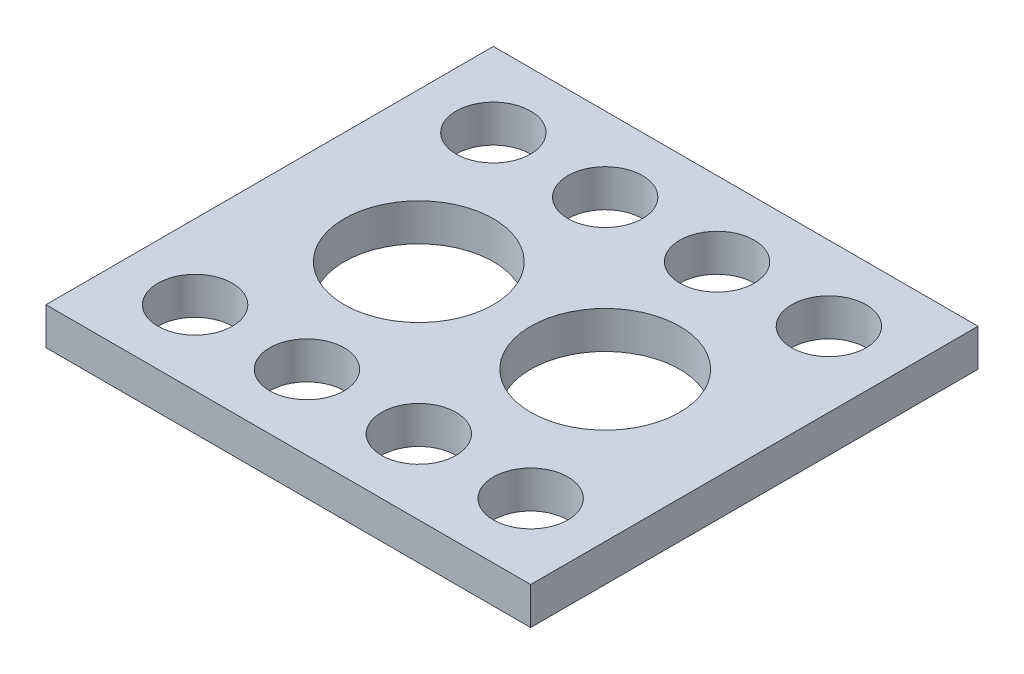
ISO-10303-21;
HEADER;
FILE_DESCRIPTION(('STEP AP214'),'2;1');
FILE_NAME('part.step','',(''),(''),'','','');
FILE_SCHEMA(('AUTOMOTIVE_DESIGN { 1 0 10303 214 1 1 1 1 }'));
ENDSEC;
DATA;
#1=APPLICATION_CONTEXT('core data for automotive mechanical design processes');
#2=APPLICATION_PROTOCOL_DEFINITION('international standard','automotive_design',2000,#1);
#3=PRODUCT_CONTEXT('',#1,'mechanical');
#4=PRODUCT('Part','Part','',(#3));
#5=PRODUCT_RELATED_PRODUCT_CATEGORY('part','',(#4));
#6=PRODUCT_DEFINITION_FORMATION('','',#4);
#7=PRODUCT_DEFINITION_CONTEXT('part definition',#1,'design');
#8=PRODUCT_DEFINITION('design','',#6,#7);
#9=PRODUCT_DEFINITION_SHAPE('','',#8);
#10=(LENGTH_UNIT() NAMED_UNIT(*) SI_UNIT(.MILLI.,.METRE.));
#11=(NAMED_UNIT(*) PLANE_ANGLE_UNIT() SI_UNIT($,.RADIAN.));
#12=(NAMED_UNIT(*) SI_UNIT($,.STERADIAN.) SOLID_ANGLE_UNIT());
#13=UNCERTAINTY_MEASURE_WITH_UNIT(LENGTH_MEASURE(1.E-05),#10,'distance_accuracy_value','');
#14=(GEOMETRIC_REPRESENTATION_CONTEXT(3) GLOBAL_UNCERTAINTY_ASSIGNED_CONTEXT((#13)) GLOBAL_UNIT_ASSIGNED_CONTEXT((#10,
#11,#12)) REPRESENTATION_CONTEXT('',''));
#15=CARTESIAN_POINT('',(0.,0.,0.));
#16=DIRECTION('',(0.,0.,1.));
#17=DIRECTION('',(1.,0.,0.));
#18=AXIS2_PLACEMENT_3D('',#15,#16,#17);
#19=CARTESIAN_POINT('',(0.,12.7,0.));
#20=DIRECTION('',(0.,-1.,0.));
#21=DIRECTION('',(0.,0.,-1.));
#22=AXIS2_PLACEMENT_3D('',#19,#20,#21);
#23=PLANE('',#22);
#24=DIRECTION('',(0.,0.,1.));
#25=VECTOR('',#24,1.);
#26=CARTESIAN_POINT('',(0.,12.7,0.));
#27=LINE('',#26,#25);
#28=CARTESIAN_POINT('',(0.,12.7,-152.4));
#29=VERTEX_POINT('',#28);
#30=CARTESIAN_POINT('',(0.,12.7,0.));
#31=VERTEX_POINT('',#30);
#32=EDGE_CURVE('E85',#29,#31,#27,.T.);
#33=ORIENTED_EDGE('',*,*,#32,.T.);
#34=DIRECTION('',(1.,0.,0.));
#35=VECTOR('',#34,1.);
#36=CARTESIAN_POINT('',(0.,12.7,0.));
#37=LINE('',#36,#35);
#38=CARTESIAN_POINT('',(165.1,12.7,0.));
#39=VERTEX_POINT('',#38);
#40=EDGE_CURVE('E80',#31,#39,#37,.T.);
#41=ORIENTED_EDGE('',*,*,#40,.T.);
#42=DIRECTION('',(0.,0.,-1.));
#43=VECTOR('',#42,1.);
#44=CARTESIAN_POINT('',(165.1,12.7,0.));
#45=LINE('',#44,#43);
#46=CARTESIAN_POINT('',(165.1,12.7,-152.4));
#47=VERTEX_POINT('',#46);
#48=EDGE_CURVE('E83',#39,#47,#45,.T.);
#49=ORIENTED_EDGE('',*,*,#48,.T.);
#50=DIRECTION('',(-1.,0.,0.));
#51=VECTOR('',#50,1.);
#52=CARTESIAN_POINT('',(0.,12.7,-152.4));
#53=LINE('',#52,#51);
#54=EDGE_CURVE('E50',#47,#29,#53,.T.);
#55=ORIENTED_EDGE('',*,*,#54,.T.);
#56=EDGE_LOOP('',(#33,#41,#49,#55));
#57=FACE_BOUND('',#56,.T.);
#58=CARTESIAN_POINT('',(25.4,12.7,-127.));
#59=DIRECTION('',(0.,1.,0.));
#60=DIRECTION('',(0.,0.,1.));
#61=AXIS2_PLACEMENT_3D('',#58,#59,#60);
#62=CIRCLE('',#61,12.7);
#63=CARTESIAN_POINT('',(25.4,12.7,-114.3));
#64=VERTEX_POINT('',#63);
#65=EDGE_CURVE('E100',#64,#64,#62,.T.);
#66=ORIENTED_EDGE('',*,*,#65,.F.);
#67=EDGE_LOOP('',(#66));
#68=FACE_BOUND('',#67,.T.);
#69=CARTESIAN_POINT('',(25.4,12.7,-25.4));
#70=DIRECTION('',(0.,1.,0.));
#71=DIRECTION('',(0.,0.,1.));
#72=AXIS2_PLACEMENT_3D('',#69,#70,#71);
#73=CIRCLE('',#72,12.7);
#74=CARTESIAN_POINT('',(25.4,12.7,-12.7));
#75=VERTEX_POINT('',#74);
#76=EDGE_CURVE('E115',#75,#75,#73,.T.);
#77=ORIENTED_EDGE('',*,*,#76,.F.);
#78=EDGE_LOOP('',(#77));
#79=FACE_BOUND('',#78,.T.);
#80=CARTESIAN_POINT('',(63.5,12.7,-127.));
#81=DIRECTION('',(0.,1.,0.));
#82=DIRECTION('',(0.,0.,1.));
#83=AXIS2_PLACEMENT_3D('',#80,#81,#82);
#84=CIRCLE('',#83,12.7);
#85=CARTESIAN_POINT('',(63.5,12.7,-114.3));
#86=VERTEX_POINT('',#85);
#87=EDGE_CURVE('E121',#86,#86,#84,.T.);
#88=ORIENTED_EDGE('',*,*,#87,.F.);
#89=EDGE_LOOP('',(#88));
#90=FACE_BOUND('',#89,.T.);
#91=CARTESIAN_POINT('',(101.6,12.7,-127.));
#92=DIRECTION('',(0.,1.,0.));
#93=DIRECTION('',(0.,0.,1.));
#94=AXIS2_PLACEMENT_3D('',#91,#92,#93);
#95=CIRCLE('',#94,12.7);
#96=CARTESIAN_POINT('',(101.6,12.7,-114.3));
#97=VERTEX_POINT('',#96);
#98=EDGE_CURVE('E127',#97,#97,#95,.T.);
#99=ORIENTED_EDGE('',*,*,#98,.F.);
#100=EDGE_LOOP('',(#99));
#101=FACE_BOUND('',#100,.T.);
#102=CARTESIAN_POINT('',(139.7,12.7,-127.));
#103=DIRECTION('',(0.,1.,0.));
#104=DIRECTION('',(0.,0.,1.));
#105=AXIS2_PLACEMENT_3D('',#102,#103,#104);
#106=CIRCLE('',#105,12.7);
#107=CARTESIAN_POINT('',(139.7,12.7,-114.3));
#108=VERTEX_POINT('',#107);
#109=EDGE_CURVE('E133',#108,#108,#106,.T.);
#110=ORIENTED_EDGE('',*,*,#109,.F.);
#111=EDGE_LOOP('',(#110));
#112=FACE_BOUND('',#111,.T.);
#113=CARTESIAN_POINT('',(63.5,12.7,-25.4));
#114=DIRECTION('',(0.,1.,0.));
#115=DIRECTION('',(0.,0.,1.));
#116=AXIS2_PLACEMENT_3D('',#113,#114,#115);
#117=CIRCLE('',#116,12.7);
#118=CARTESIAN_POINT('',(63.5,12.7,-12.7));
#119=VERTEX_POINT('',#118);
#120=EDGE_CURVE('E139',#119,#119,#117,.T.);
#121=ORIENTED_EDGE('',*,*,#120,.F.);
#122=EDGE_LOOP('',(#121));
#123=FACE_BOUND('',#122,.T.);
#124=CARTESIAN_POINT('',(101.6,12.7,-25.4));
#125=DIRECTION('',(0.,1.,0.));
#126=DIRECTION('',(0.,0.,1.));
#127=AXIS2_PLACEMENT_3D('',#124,#125,#126);
#128=CIRCLE('',#127,12.7);
#129=CARTESIAN_POINT('',(101.6,12.7,-12.7));
#130=VERTEX_POINT('',#129);
#131=EDGE_CURVE('E145',#130,#130,#128,.T.);
#132=ORIENTED_EDGE('',*,*,#131,.F.);
#133=EDGE_LOOP('',(#132));
#134=FACE_BOUND('',#133,.T.);
#135=CARTESIAN_POINT('',(139.7,12.7,-25.4));
#136=DIRECTION('',(0.,1.,0.));
#137=DIRECTION('',(0.,0.,1.));
#138=AXIS2_PLACEMENT_3D('',#135,#136,#137);
#139=CIRCLE('',#138,12.7);
#140=CARTESIAN_POINT('',(139.7,12.7,-12.7));
#141=VERTEX_POINT('',#140);
#142=EDGE_CURVE('E151',#141,#141,#139,.T.);
#143=ORIENTED_EDGE('',*,*,#142,.F.);
#144=EDGE_LOOP('',(#143));
#145=FACE_BOUND('',#144,.T.);
#146=CARTESIAN_POINT('',(50.8,12.7,-76.2));
#147=DIRECTION('',(0.,1.,0.));
#148=DIRECTION('',(0.,0.,1.));
#149=AXIS2_PLACEMENT_3D('',#146,#147,#148);
#150=CIRCLE('',#149,25.4);
#151=CARTESIAN_POINT('',(50.8,12.7,-50.8));
#152=VERTEX_POINT('',#151);
#153=EDGE_CURVE('E157',#152,#152,#150,.T.);
#154=ORIENTED_EDGE('',*,*,#153,.F.);
#155=EDGE_LOOP('',(#154));
#156=FACE_BOUND('',#155,.T.);
#157=CARTESIAN_POINT('',(114.3,12.7,-76.2));
#158=DIRECTION('',(0.,1.,0.));
#159=DIRECTION('',(0.,0.,1.));
#160=AXIS2_PLACEMENT_3D('',#157,#158,#159);
#161=CIRCLE('',#160,25.4);
#162=CARTESIAN_POINT('',(114.3,12.7,-50.8));
#163=VERTEX_POINT('',#162);
#164=EDGE_CURVE('E163',#163,#163,#161,.T.);
#165=ORIENTED_EDGE('',*,*,#164,.F.);
#166=EDGE_LOOP('',(#165));
#167=FACE_BOUND('',#166,.T.);
#168=ADVANCED_FACE('F33',(#57,#68,#79,#90,#101,#112,#123,#134,#145,#156,#167),#23,.F.);
#169=CARTESIAN_POINT('',(0.,0.,0.));
#170=DIRECTION('',(0.,-1.,0.));
#171=DIRECTION('',(0.,0.,-1.));
#172=AXIS2_PLACEMENT_3D('',#169,#170,#171);
#173=PLANE('',#172);
#174=CARTESIAN_POINT('',(50.8,0.,-76.2));
#175=DIRECTION('',(0.,1.,0.));
#176=DIRECTION('',(0.,0.,1.));
#177=AXIS2_PLACEMENT_3D('',#174,#175,#176);
#178=CIRCLE('',#177,25.4);
#179=CARTESIAN_POINT('',(50.8,0.,-50.8));
#180=VERTEX_POINT('',#179);
#181=EDGE_CURVE('E160',#180,#180,#178,.T.);
#182=ORIENTED_EDGE('',*,*,#181,.T.);
#183=EDGE_LOOP('',(#182));
#184=FACE_BOUND('',#183,.T.);
#185=CARTESIAN_POINT('',(101.6,0.,-25.4));
#186=DIRECTION('',(0.,1.,0.));
#187=DIRECTION('',(0.,0.,1.));
#188=AXIS2_PLACEMENT_3D('',#185,#186,#187);
#189=CIRCLE('',#188,12.7);
#190=CARTESIAN_POINT('',(101.6,0.,-12.7));
#191=VERTEX_POINT('',#190);
#192=EDGE_CURVE('E148',#191,#191,#189,.T.);
#193=ORIENTED_EDGE('',*,*,#192,.T.);
#194=EDGE_LOOP('',(#193));
#195=FACE_BOUND('',#194,.T.);
#196=CARTESIAN_POINT('',(139.7,0.,-127.));
#197=DIRECTION('',(0.,1.,0.));
#198=DIRECTION('',(0.,0.,1.));
#199=AXIS2_PLACEMENT_3D('',#196,#197,#198);
#200=CIRCLE('',#199,12.7);
#201=CARTESIAN_POINT('',(139.7,0.,-114.3));
#202=VERTEX_POINT('',#201);
#203=EDGE_CURVE('E136',#202,#202,#200,.T.);
#204=ORIENTED_EDGE('',*,*,#203,.T.);
#205=EDGE_LOOP('',(#204));
#206=FACE_BOUND('',#205,.T.);
#207=CARTESIAN_POINT('',(63.5,0.,-127.));
#208=DIRECTION('',(0.,1.,0.));
#209=DIRECTION('',(0.,0.,1.));
#210=AXIS2_PLACEMENT_3D('',#207,#208,#209);
#211=CIRCLE('',#210,12.7);
#212=CARTESIAN_POINT('',(63.5,0.,-114.3));
#213=VERTEX_POINT('',#212);
#214=EDGE_CURVE('E124',#213,#213,#211,.T.);
#215=ORIENTED_EDGE('',*,*,#214,.T.);
#216=EDGE_LOOP('',(#215));
#217=FACE_BOUND('',#216,.T.);
#218=CARTESIAN_POINT('',(25.4,0.,-127.));
#219=DIRECTION('',(0.,1.,0.));
#220=DIRECTION('',(0.,0.,1.));
#221=AXIS2_PLACEMENT_3D('',#218,#219,#220);
#222=CIRCLE('',#221,12.7);
#223=CARTESIAN_POINT('',(25.4,0.,-114.3));
#224=VERTEX_POINT('',#223);
#225=EDGE_CURVE('E112',#224,#224,#222,.T.);
#226=ORIENTED_EDGE('',*,*,#225,.T.);
#227=EDGE_LOOP('',(#226));
#228=FACE_BOUND('',#227,.T.);
#229=DIRECTION('',(0.,0.,1.));
#230=VECTOR('',#229,1.);
#231=CARTESIAN_POINT('',(0.,0.,0.));
#232=LINE('',#231,#230);
#233=CARTESIAN_POINT('',(0.,0.,-152.4));
#234=VERTEX_POINT('',#233);
#235=CARTESIAN_POINT('',(0.,0.,0.));
#236=VERTEX_POINT('',#235);
#237=EDGE_CURVE('E97',#234,#236,#232,.T.);
#238=ORIENTED_EDGE('',*,*,#237,.F.);
#239=DIRECTION('',(-1.,0.,0.));
#240=VECTOR('',#239,1.);
#241=CARTESIAN_POINT('',(0.,0.,-152.4));
#242=LINE('',#241,#240);
#243=CARTESIAN_POINT('',(165.1,0.,-152.4));
#244=VERTEX_POINT('',#243);
#245=EDGE_CURVE('E73',#244,#234,#242,.T.);
#246=ORIENTED_EDGE('',*,*,#245,.F.);
#247=DIRECTION('',(0.,0.,-1.));
#248=VECTOR('',#247,1.);
#249=CARTESIAN_POINT('',(165.1,0.,0.));
#250=LINE('',#249,#248);
#251=CARTESIAN_POINT('',(165.1,0.,0.));
#252=VERTEX_POINT('',#251);
#253=EDGE_CURVE('E67',#252,#244,#250,.T.);
#254=ORIENTED_EDGE('',*,*,#253,.F.);
#255=DIRECTION('',(1.,0.,0.));
#256=VECTOR('',#255,1.);
#257=CARTESIAN_POINT('',(0.,0.,0.));
#258=LINE('',#257,#256);
#259=EDGE_CURVE('E89',#236,#252,#258,.T.);
#260=ORIENTED_EDGE('',*,*,#259,.F.);
#261=EDGE_LOOP('',(#238,#246,#254,#260));
#262=FACE_BOUND('',#261,.T.);
#263=CARTESIAN_POINT('',(25.4,0.,-25.4));
#264=DIRECTION('',(0.,1.,0.));
#265=DIRECTION('',(0.,0.,1.));
#266=AXIS2_PLACEMENT_3D('',#263,#264,#265);
#267=CIRCLE('',#266,12.7);
#268=CARTESIAN_POINT('',(25.4,0.,-12.7));
#269=VERTEX_POINT('',#268);
#270=EDGE_CURVE('E118',#269,#269,#267,.T.);
#271=ORIENTED_EDGE('',*,*,#270,.T.);
#272=EDGE_LOOP('',(#271));
#273=FACE_BOUND('',#272,.T.);
#274=CARTESIAN_POINT('',(101.6,0.,-127.));
#275=DIRECTION('',(0.,1.,0.));
#276=DIRECTION('',(0.,0.,1.));
#277=AXIS2_PLACEMENT_3D('',#274,#275,#276);
#278=CIRCLE('',#277,12.7);
#279=CARTESIAN_POINT('',(101.6,0.,-114.3));
#280=VERTEX_POINT('',#279);
#281=EDGE_CURVE('E130',#280,#280,#278,.T.);
#282=ORIENTED_EDGE('',*,*,#281,.T.);
#283=EDGE_LOOP('',(#282));
#284=FACE_BOUND('',#283,.T.);
#285=CARTESIAN_POINT('',(63.5,0.,-25.4));
#286=DIRECTION('',(0.,1.,0.));
#287=DIRECTION('',(0.,0.,1.));
#288=AXIS2_PLACEMENT_3D('',#285,#286,#287);
#289=CIRCLE('',#288,12.7);
#290=CARTESIAN_POINT('',(63.5,0.,-12.7));
#291=VERTEX_POINT('',#290);
#292=EDGE_CURVE('E142',#291,#291,#289,.T.);
#293=ORIENTED_EDGE('',*,*,#292,.T.);
#294=EDGE_LOOP('',(#293));
#295=FACE_BOUND('',#294,.T.);
#296=CARTESIAN_POINT('',(139.7,0.,-25.4));
#297=DIRECTION('',(0.,1.,0.));
#298=DIRECTION('',(0.,0.,1.));
#299=AXIS2_PLACEMENT_3D('',#296,#297,#298);
#300=CIRCLE('',#299,12.7);
#301=CARTESIAN_POINT('',(139.7,0.,-12.7));
#302=VERTEX_POINT('',#301);
#303=EDGE_CURVE('E154',#302,#302,#300,.T.);
#304=ORIENTED_EDGE('',*,*,#303,.T.);
#305=EDGE_LOOP('',(#304));
#306=FACE_BOUND('',#305,.T.);
#307=CARTESIAN_POINT('',(114.3,0.,-76.2));
#308=DIRECTION('',(0.,1.,0.));
#309=DIRECTION('',(0.,0.,1.));
#310=AXIS2_PLACEMENT_3D('',#307,#308,#309);
#311=CIRCLE('',#310,25.4);
#312=CARTESIAN_POINT('',(114.3,0.,-50.8));
#313=VERTEX_POINT('',#312);
#314=EDGE_CURVE('E166',#313,#313,#311,.T.);
#315=ORIENTED_EDGE('',*,*,#314,.T.);
#316=EDGE_LOOP('',(#315));
#317=FACE_BOUND('',#316,.T.);
#318=ADVANCED_FACE('F108',(#184,#195,#206,#217,#228,#262,#273,#284,#295,#306,#317),#173,.T.);
#319=CARTESIAN_POINT('',(0.,12.7,0.));
#320=DIRECTION('',(1.,0.,0.));
#321=DIRECTION('',(0.,0.,-1.));
#322=AXIS2_PLACEMENT_3D('',#319,#320,#321);
#323=PLANE('',#322);
#324=ORIENTED_EDGE('',*,*,#237,.T.);
#325=DIRECTION('',(0.,-1.,0.));
#326=VECTOR('',#325,1.);
#327=CARTESIAN_POINT('',(0.,12.7,0.));
#328=LINE('',#327,#326);
#329=EDGE_CURVE('E11',#31,#236,#328,.T.);
#330=ORIENTED_EDGE('',*,*,#329,.F.);
#331=ORIENTED_EDGE('',*,*,#32,.F.);
#332=DIRECTION('',(0.,-1.,0.));
#333=VECTOR('',#332,1.);
#334=CARTESIAN_POINT('',(0.,12.7,-152.4));
#335=LINE('',#334,#333);
#336=EDGE_CURVE('E93',#29,#234,#335,.T.);
#337=ORIENTED_EDGE('',*,*,#336,.T.);
#338=EDGE_LOOP('',(#324,#330,#331,#337));
#339=FACE_BOUND('',#338,.T.);
#340=ADVANCED_FACE('F35',(#339),#323,.F.);
#341=CARTESIAN_POINT('',(0.,12.7,0.));
#342=DIRECTION('',(0.,0.,-1.));
#343=DIRECTION('',(-1.,0.,0.));
#344=AXIS2_PLACEMENT_3D('',#341,#342,#343);
#345=PLANE('',#344);
#346=ORIENTED_EDGE('',*,*,#259,.T.);
#347=DIRECTION('',(0.,-1.,0.));
#348=VECTOR('',#347,1.);
#349=CARTESIAN_POINT('',(165.1,12.7,0.));
#350=LINE('',#349,#348);
#351=EDGE_CURVE('E42',#39,#252,#350,.T.);
#352=ORIENTED_EDGE('',*,*,#351,.F.);
#353=ORIENTED_EDGE('',*,*,#40,.F.);
#354=ORIENTED_EDGE('',*,*,#329,.T.);
#355=EDGE_LOOP('',(#346,#352,#353,#354));
#356=FACE_BOUND('',#355,.T.);
#357=ADVANCED_FACE('F88',(#356),#345,.F.);
#358=CARTESIAN_POINT('',(165.1,12.7,0.));
#359=DIRECTION('',(-1.,0.,0.));
#360=DIRECTION('',(0.,0.,1.));
#361=AXIS2_PLACEMENT_3D('',#358,#359,#360);
#362=PLANE('',#361);
#363=ORIENTED_EDGE('',*,*,#253,.T.);
#364=DIRECTION('',(0.,-1.,0.));
#365=VECTOR('',#364,1.);
#366=CARTESIAN_POINT('',(165.1,12.7,-152.4));
#367=LINE('',#366,#365);
#368=EDGE_CURVE('E90',#47,#244,#367,.T.);
#369=ORIENTED_EDGE('',*,*,#368,.F.);
#370=ORIENTED_EDGE('',*,*,#48,.F.);
#371=ORIENTED_EDGE('',*,*,#351,.T.);
#372=EDGE_LOOP('',(#363,#369,#370,#371));
#373=FACE_BOUND('',#372,.T.);
#374=ADVANCED_FACE('F91',(#373),#362,.F.);
#375=CARTESIAN_POINT('',(0.,12.7,-152.4));
#376=DIRECTION('',(0.,0.,1.));
#377=DIRECTION('',(1.,0.,0.));
#378=AXIS2_PLACEMENT_3D('',#375,#376,#377);
#379=PLANE('',#378);
#380=ORIENTED_EDGE('',*,*,#245,.T.);
#381=ORIENTED_EDGE('',*,*,#336,.F.);
#382=ORIENTED_EDGE('',*,*,#54,.F.);
#383=ORIENTED_EDGE('',*,*,#368,.T.);
#384=EDGE_LOOP('',(#380,#381,#382,#383));
#385=FACE_BOUND('',#384,.T.);
#386=ADVANCED_FACE('F105',(#385),#379,.F.);
#387=CARTESIAN_POINT('',(25.4,12.7,-127.));
#388=DIRECTION('',(0.,-1.,0.));
#389=DIRECTION('',(0.,0.,-1.));
#390=AXIS2_PLACEMENT_3D('',#387,#388,#389);
#391=CYLINDRICAL_SURFACE('',#390,12.7);
#392=ORIENTED_EDGE('',*,*,#65,.T.);
#393=EDGE_LOOP('',(#392));
#394=FACE_BOUND('',#393,.T.);
#395=ORIENTED_EDGE('',*,*,#225,.F.);
#396=EDGE_LOOP('',(#395));
#397=FACE_BOUND('',#396,.T.);
#398=ADVANCED_FACE('F183',(#394,#397),#391,.F.);
#399=CARTESIAN_POINT('',(25.4,12.7,-25.4));
#400=DIRECTION('',(0.,-1.,0.));
#401=DIRECTION('',(0.,0.,-1.));
#402=AXIS2_PLACEMENT_3D('',#399,#400,#401);
#403=CYLINDRICAL_SURFACE('',#402,12.7);
#404=ORIENTED_EDGE('',*,*,#76,.T.);
#405=EDGE_LOOP('',(#404));
#406=FACE_BOUND('',#405,.T.);
#407=ORIENTED_EDGE('',*,*,#270,.F.);
#408=EDGE_LOOP('',(#407));
#409=FACE_BOUND('',#408,.T.);
#410=ADVANCED_FACE('F229',(#406,#409),#403,.F.);
#411=CARTESIAN_POINT('',(63.5,12.7,-127.));
#412=DIRECTION('',(0.,-1.,0.));
#413=DIRECTION('',(0.,0.,-1.));
#414=AXIS2_PLACEMENT_3D('',#411,#412,#413);
#415=CYLINDRICAL_SURFACE('',#414,12.7);
#416=ORIENTED_EDGE('',*,*,#87,.T.);
#417=EDGE_LOOP('',(#416));
#418=FACE_BOUND('',#417,.T.);
#419=ORIENTED_EDGE('',*,*,#214,.F.);
#420=EDGE_LOOP('',(#419));
#421=FACE_BOUND('',#420,.T.);
#422=ADVANCED_FACE('F237',(#418,#421),#415,.F.);
#423=CARTESIAN_POINT('',(101.6,12.7,-127.));
#424=DIRECTION('',(0.,-1.,0.));
#425=DIRECTION('',(0.,0.,-1.));
#426=AXIS2_PLACEMENT_3D('',#423,#424,#425);
#427=CYLINDRICAL_SURFACE('',#426,12.7);
#428=ORIENTED_EDGE('',*,*,#98,.T.);
#429=EDGE_LOOP('',(#428));
#430=FACE_BOUND('',#429,.T.);
#431=ORIENTED_EDGE('',*,*,#281,.F.);
#432=EDGE_LOOP('',(#431));
#433=FACE_BOUND('',#432,.T.);
#434=ADVANCED_FACE('F245',(#430,#433),#427,.F.);
#435=CARTESIAN_POINT('',(139.7,12.7,-127.));
#436=DIRECTION('',(0.,-1.,0.));
#437=DIRECTION('',(0.,0.,-1.));
#438=AXIS2_PLACEMENT_3D('',#435,#436,#437);
#439=CYLINDRICAL_SURFACE('',#438,12.7);
#440=ORIENTED_EDGE('',*,*,#109,.T.);
#441=EDGE_LOOP('',(#440));
#442=FACE_BOUND('',#441,.T.);
#443=ORIENTED_EDGE('',*,*,#203,.F.);
#444=EDGE_LOOP('',(#443));
#445=FACE_BOUND('',#444,.T.);
#446=ADVANCED_FACE('F254',(#442,#445),#439,.F.);
#447=CARTESIAN_POINT('',(63.5,12.7,-25.4));
#448=DIRECTION('',(0.,-1.,0.));
#449=DIRECTION('',(0.,0.,-1.));
#450=AXIS2_PLACEMENT_3D('',#447,#448,#449);
#451=CYLINDRICAL_SURFACE('',#450,12.7);
#452=ORIENTED_EDGE('',*,*,#120,.T.);
#453=EDGE_LOOP('',(#452));
#454=FACE_BOUND('',#453,.T.);
#455=ORIENTED_EDGE('',*,*,#292,.F.);
#456=EDGE_LOOP('',(#455));
#457=FACE_BOUND('',#456,.T.);
#458=ADVANCED_FACE('F263',(#454,#457),#451,.F.);
#459=CARTESIAN_POINT('',(101.6,12.7,-25.4));
#460=DIRECTION('',(0.,-1.,0.));
#461=DIRECTION('',(0.,0.,-1.));
#462=AXIS2_PLACEMENT_3D('',#459,#460,#461);
#463=CYLINDRICAL_SURFACE('',#462,12.7);
#464=ORIENTED_EDGE('',*,*,#131,.T.);
#465=EDGE_LOOP('',(#464));
#466=FACE_BOUND('',#465,.T.);
#467=ORIENTED_EDGE('',*,*,#192,.F.);
#468=EDGE_LOOP('',(#467));
#469=FACE_BOUND('',#468,.T.);
#470=ADVANCED_FACE('F272',(#466,#469),#463,.F.);
#471=CARTESIAN_POINT('',(139.7,12.7,-25.4));
#472=DIRECTION('',(0.,-1.,0.));
#473=DIRECTION('',(0.,0.,-1.));
#474=AXIS2_PLACEMENT_3D('',#471,#472,#473);
#475=CYLINDRICAL_SURFACE('',#474,12.7);
#476=ORIENTED_EDGE('',*,*,#142,.T.);
#477=EDGE_LOOP('',(#476));
#478=FACE_BOUND('',#477,.T.);
#479=ORIENTED_EDGE('',*,*,#303,.F.);
#480=EDGE_LOOP('',(#479));
#481=FACE_BOUND('',#480,.T.);
#482=ADVANCED_FACE('F281',(#478,#481),#475,.F.);
#483=CARTESIAN_POINT('',(50.8,12.7,-76.2));
#484=DIRECTION('',(0.,-1.,0.));
#485=DIRECTION('',(0.,0.,-1.));
#486=AXIS2_PLACEMENT_3D('',#483,#484,#485);
#487=CYLINDRICAL_SURFACE('',#486,25.4);
#488=ORIENTED_EDGE('',*,*,#153,.T.);
#489=EDGE_LOOP('',(#488));
#490=FACE_BOUND('',#489,.T.);
#491=ORIENTED_EDGE('',*,*,#181,.F.);
#492=EDGE_LOOP('',(#491));
#493=FACE_BOUND('',#492,.T.);
#494=ADVANCED_FACE('F290',(#490,#493),#487,.F.);
#495=CARTESIAN_POINT('',(114.3,12.7,-76.2));
#496=DIRECTION('',(0.,-1.,0.));
#497=DIRECTION('',(0.,0.,-1.));
#498=AXIS2_PLACEMENT_3D('',#495,#496,#497);
#499=CYLINDRICAL_SURFACE('',#498,25.4);
#500=ORIENTED_EDGE('',*,*,#164,.T.);
#501=EDGE_LOOP('',(#500));
#502=FACE_BOUND('',#501,.T.);
#503=ORIENTED_EDGE('',*,*,#314,.F.);
#504=EDGE_LOOP('',(#503));
#505=FACE_BOUND('',#504,.T.);
#506=ADVANCED_FACE('F172',(#502,#505),#499,.F.);
#507=CLOSED_SHELL('',(#168,#318,#340,#357,#374,#386,#398,#410,#422,#434,#446,#458,#470,#482,
#494,#506));
#508=MANIFOLD_SOLID_BREP('B2',#507);
#509=ADVANCED_BREP_SHAPE_REPRESENTATION('',(#18,#508),#14);
#510=SHAPE_DEFINITION_REPRESENTATION(#9,#509);
ENDSEC;
END-ISO-10303-21;
